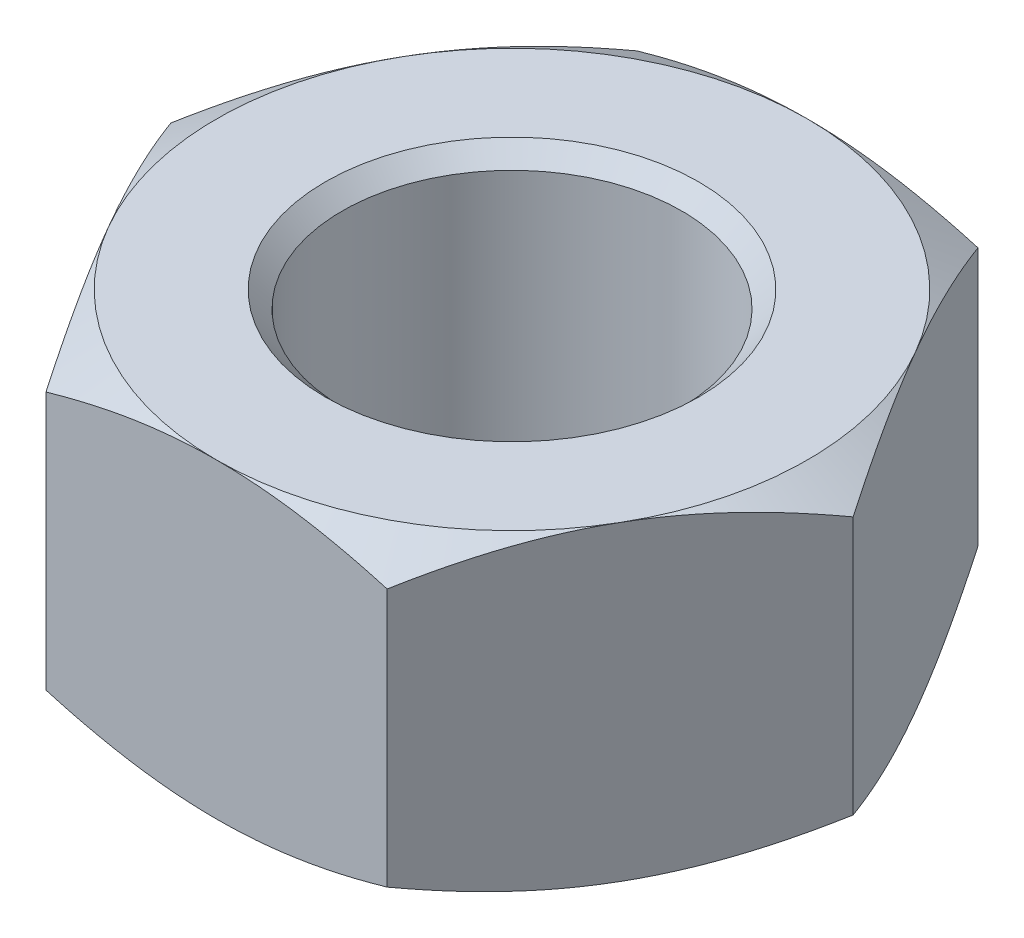
ISO-10303-21;
HEADER;
FILE_DESCRIPTION(('STEP AP214'),'2;1');
FILE_NAME('part.step','',(''),(''),'','','');
FILE_SCHEMA(('AUTOMOTIVE_DESIGN { 1 0 10303 214 1 1 1 1 }'));
ENDSEC;
DATA;
#1=APPLICATION_CONTEXT('core data for automotive mechanical design processes');
#2=APPLICATION_PROTOCOL_DEFINITION('international standard','automotive_design',2000,#1);
#3=PRODUCT_CONTEXT('',#1,'mechanical');
#4=PRODUCT('Part','Part','',(#3));
#5=PRODUCT_RELATED_PRODUCT_CATEGORY('part','',(#4));
#6=PRODUCT_DEFINITION_FORMATION('','',#4);
#7=PRODUCT_DEFINITION_CONTEXT('part definition',#1,'design');
#8=PRODUCT_DEFINITION('design','',#6,#7);
#9=PRODUCT_DEFINITION_SHAPE('','',#8);
#10=(LENGTH_UNIT() NAMED_UNIT(*) SI_UNIT(.MILLI.,.METRE.));
#11=(NAMED_UNIT(*) PLANE_ANGLE_UNIT() SI_UNIT($,.RADIAN.));
#12=(NAMED_UNIT(*) SI_UNIT($,.STERADIAN.) SOLID_ANGLE_UNIT());
#13=UNCERTAINTY_MEASURE_WITH_UNIT(LENGTH_MEASURE(1.E-05),#10,'distance_accuracy_value','');
#14=(GEOMETRIC_REPRESENTATION_CONTEXT(3) GLOBAL_UNCERTAINTY_ASSIGNED_CONTEXT((#13)) GLOBAL_UNIT_ASSIGNED_CONTEXT((#10,
#11,#12)) REPRESENTATION_CONTEXT('',''));
#15=CARTESIAN_POINT('',(0.,0.,0.));
#16=DIRECTION('',(0.,0.,1.));
#17=DIRECTION('',(1.,0.,0.));
#18=AXIS2_PLACEMENT_3D('',#15,#16,#17);
#19=CARTESIAN_POINT('',(-38.7727586640478,-69.,-4.75));
#20=DIRECTION('',(0.866025403784439,0.,-0.5));
#21=DIRECTION('',(-0.5,0.,-0.866025403784439));
#22=AXIS2_PLACEMENT_3D('',#19,#20,#21);
#23=PLANE('',#22);
#24=CARTESIAN_POINT('',(-41.5180162225476,-67.1498517286183,-9.50492557118405));
#25=CARTESIAN_POINT('',(-40.0466600833053,-68.,-6.95646198198795));
#26=CARTESIAN_POINT('',(-38.7727586640478,-68.,-4.75));
#27=CARTESIAN_POINT('',(-37.4988572447905,-68.0000000000001,-2.54353801801205));
#28=CARTESIAN_POINT('',(-36.0275011055481,-67.1498517286183,0.00492557118405202));
#29=(BOUNDED_CURVE() B_SPLINE_CURVE(2,(#24,#25,#26,#27,#28),.UNSPECIFIED.,.F.,
.F.) B_SPLINE_CURVE_WITH_KNOTS((3,2,3),(0.,5.57015057763849,11.140301155277),
.UNSPECIFIED.) CURVE() GEOMETRIC_REPRESENTATION_ITEM() RATIONAL_B_SPLINE_CURVE((1.,
1.03802697460132,1.,1.03802697460132,1.)) REPRESENTATION_ITEM(''));
#30=CARTESIAN_POINT('',(-41.5151724426986,-67.1514942239681,-9.5));
#31=VERTEX_POINT('',#30);
#32=CARTESIAN_POINT('',(-38.7727586640478,-68.,-4.75));
#33=VERTEX_POINT('',#32);
#34=EDGE_CURVE('E194',#31,#33,#29,.T.);
#35=ORIENTED_EDGE('',*,*,#34,.F.);
#36=DIRECTION('',(0.,1.,0.));
#37=VECTOR('',#36,1.);
#38=CARTESIAN_POINT('',(-41.5151724426986,-69.,-9.5));
#39=LINE('',#38,#37);
#40=CARTESIAN_POINT('',(-41.5151724426986,-58.8485057760319,-9.5));
#41=VERTEX_POINT('',#40);
#42=EDGE_CURVE('E11',#31,#41,#39,.T.);
#43=ORIENTED_EDGE('',*,*,#42,.T.);
#44=CARTESIAN_POINT('',(-36.0275011055481,-58.8501482713817,0.00492557118405869));
#45=CARTESIAN_POINT('',(-37.4988572447904,-58.,-2.54353801801204));
#46=CARTESIAN_POINT('',(-38.7727586640478,-58.,-4.75));
#47=CARTESIAN_POINT('',(-40.0466600833052,-58.,-6.95646198198795));
#48=CARTESIAN_POINT('',(-41.5180162225476,-58.8501482713817,-9.50492557118406));
#49=(BOUNDED_CURVE() B_SPLINE_CURVE(2,(#44,#45,#46,#47,#48),.UNSPECIFIED.,.F.,
.F.) B_SPLINE_CURVE_WITH_KNOTS((3,2,3),(0.,5.57015057763849,11.140301155277),
.UNSPECIFIED.) CURVE() GEOMETRIC_REPRESENTATION_ITEM() RATIONAL_B_SPLINE_CURVE((1.,
1.03802697460132,1.,1.03802697460132,1.)) REPRESENTATION_ITEM(''));
#50=CARTESIAN_POINT('',(-38.7727586640478,-58.,-4.75));
#51=VERTEX_POINT('',#50);
#52=EDGE_CURVE('E256',#51,#41,#49,.T.);
#53=ORIENTED_EDGE('',*,*,#52,.F.);
#54=CARTESIAN_POINT('',(-36.0275011055481,-58.8501482713817,0.00492557118405869));
#55=CARTESIAN_POINT('',(-37.4988572447904,-58.,-2.54353801801204));
#56=CARTESIAN_POINT('',(-38.7727586640478,-58.,-4.75));
#57=CARTESIAN_POINT('',(-40.0466600833052,-58.,-6.95646198198795));
#58=CARTESIAN_POINT('',(-41.5180162225476,-58.8501482713817,-9.50492557118406));
#59=(BOUNDED_CURVE() B_SPLINE_CURVE(2,(#54,#55,#56,#57,#58),.UNSPECIFIED.,.F.,
.F.) B_SPLINE_CURVE_WITH_KNOTS((3,2,3),(0.,5.57015057763849,11.140301155277),
.UNSPECIFIED.) CURVE() GEOMETRIC_REPRESENTATION_ITEM() RATIONAL_B_SPLINE_CURVE((1.,
1.03802697460132,1.,1.03802697460132,1.)) REPRESENTATION_ITEM(''));
#60=CARTESIAN_POINT('',(-36.0303448853971,-58.8485057760319,0.));
#61=VERTEX_POINT('',#60);
#62=EDGE_CURVE('E310',#61,#51,#59,.T.);
#63=ORIENTED_EDGE('',*,*,#62,.F.);
#64=DIRECTION('',(0.,1.,0.));
#65=VECTOR('',#64,1.);
#66=CARTESIAN_POINT('',(-36.0303448853971,-69.,0.));
#67=LINE('',#66,#65);
#68=CARTESIAN_POINT('',(-36.0303448853971,-67.1514942239681,0.));
#69=VERTEX_POINT('',#68);
#70=EDGE_CURVE('E125',#69,#61,#67,.T.);
#71=ORIENTED_EDGE('',*,*,#70,.F.);
#72=CARTESIAN_POINT('',(-41.5180162225476,-67.1498517286183,-9.50492557118405));
#73=CARTESIAN_POINT('',(-40.0466600833053,-68.,-6.95646198198795));
#74=CARTESIAN_POINT('',(-38.7727586640478,-68.,-4.75));
#75=CARTESIAN_POINT('',(-37.4988572447905,-68.0000000000001,-2.54353801801205));
#76=CARTESIAN_POINT('',(-36.0275011055481,-67.1498517286183,0.00492557118405202));
#77=(BOUNDED_CURVE() B_SPLINE_CURVE(2,(#72,#73,#74,#75,#76),.UNSPECIFIED.,.F.,
.F.) B_SPLINE_CURVE_WITH_KNOTS((3,2,3),(0.,5.57015057763849,11.140301155277),
.UNSPECIFIED.) CURVE() GEOMETRIC_REPRESENTATION_ITEM() RATIONAL_B_SPLINE_CURVE((1.,
1.03802697460132,1.,1.03802697460132,1.)) REPRESENTATION_ITEM(''));
#78=EDGE_CURVE('E265',#33,#69,#77,.T.);
#79=ORIENTED_EDGE('',*,*,#78,.F.);
#80=EDGE_LOOP('',(#35,#43,#53,#63,#71,#79));
#81=FACE_BOUND('',#80,.T.);
#82=ADVANCED_FACE('F16',(#81),#23,.T.);
#83=CARTESIAN_POINT('',(-47.,-69.,-9.5));
#84=DIRECTION('',(0.,0.,-1.));
#85=DIRECTION('',(-1.,0.,0.));
#86=AXIS2_PLACEMENT_3D('',#83,#84,#85);
#87=PLANE('',#86);
#88=CARTESIAN_POINT('',(-52.4905151169995,-67.1498517286183,-9.5));
#89=CARTESIAN_POINT('',(-49.5478028385149,-68.0000000000001,-9.50000000000001));
#90=CARTESIAN_POINT('',(-47.,-68.,-9.5));
#91=CARTESIAN_POINT('',(-44.4521971614852,-68.0000000000001,-9.50000000000001));
#92=CARTESIAN_POINT('',(-41.5094848830005,-67.1498517286183,-9.5));
#93=(BOUNDED_CURVE() B_SPLINE_CURVE(2,(#88,#89,#90,#91,#92),.UNSPECIFIED.,.F.,
.F.) B_SPLINE_CURVE_WITH_KNOTS((3,2,3),(0.,5.57015057763849,11.140301155277),
.UNSPECIFIED.) CURVE() GEOMETRIC_REPRESENTATION_ITEM() RATIONAL_B_SPLINE_CURVE((1.,
1.03802697460134,1.,1.03802697460134,1.)) REPRESENTATION_ITEM(''));
#94=CARTESIAN_POINT('',(-52.4848275573015,-67.1514942239681,-9.5));
#95=VERTEX_POINT('',#94);
#96=CARTESIAN_POINT('',(-47.,-68.,-9.5));
#97=VERTEX_POINT('',#96);
#98=EDGE_CURVE('E137',#95,#97,#93,.T.);
#99=ORIENTED_EDGE('',*,*,#98,.F.);
#100=DIRECTION('',(0.,1.,0.));
#101=VECTOR('',#100,1.);
#102=CARTESIAN_POINT('',(-52.4848275573015,-69.,-9.5));
#103=LINE('',#102,#101);
#104=CARTESIAN_POINT('',(-52.4848275573015,-58.8485057760319,-9.5));
#105=VERTEX_POINT('',#104);
#106=EDGE_CURVE('E28',#95,#105,#103,.T.);
#107=ORIENTED_EDGE('',*,*,#106,.T.);
#108=CARTESIAN_POINT('',(-41.5094848830005,-58.8501482713817,-9.5));
#109=CARTESIAN_POINT('',(-44.4521971614851,-58.,-9.50000000000001));
#110=CARTESIAN_POINT('',(-47.,-58.,-9.5));
#111=CARTESIAN_POINT('',(-49.5478028385149,-58.,-9.50000000000001));
#112=CARTESIAN_POINT('',(-52.4905151169995,-58.8501482713817,-9.5));
#113=(BOUNDED_CURVE() B_SPLINE_CURVE(2,(#108,#109,#110,#111,#112),.UNSPECIFIED.,.F.,
.F.) B_SPLINE_CURVE_WITH_KNOTS((3,2,3),(0.,5.5701505776385,11.140301155277),
.UNSPECIFIED.) CURVE() GEOMETRIC_REPRESENTATION_ITEM() RATIONAL_B_SPLINE_CURVE((1.,
1.03802697460132,1.,1.03802697460132,1.)) REPRESENTATION_ITEM(''));
#114=CARTESIAN_POINT('',(-47.,-58.,-9.5));
#115=VERTEX_POINT('',#114);
#116=EDGE_CURVE('E20',#115,#105,#113,.T.);
#117=ORIENTED_EDGE('',*,*,#116,.F.);
#118=CARTESIAN_POINT('',(-41.5094848830005,-58.8501482713817,-9.5));
#119=CARTESIAN_POINT('',(-44.4521971614851,-58.,-9.50000000000001));
#120=CARTESIAN_POINT('',(-47.,-58.,-9.5));
#121=CARTESIAN_POINT('',(-49.5478028385149,-58.,-9.50000000000001));
#122=CARTESIAN_POINT('',(-52.4905151169995,-58.8501482713817,-9.5));
#123=(BOUNDED_CURVE() B_SPLINE_CURVE(2,(#118,#119,#120,#121,#122),.UNSPECIFIED.,.F.,
.F.) B_SPLINE_CURVE_WITH_KNOTS((3,2,3),(0.,5.5701505776385,11.140301155277),
.UNSPECIFIED.) CURVE() GEOMETRIC_REPRESENTATION_ITEM() RATIONAL_B_SPLINE_CURVE((1.,
1.03802697460132,1.,1.03802697460132,1.)) REPRESENTATION_ITEM(''));
#124=EDGE_CURVE('E247',#41,#115,#123,.T.);
#125=ORIENTED_EDGE('',*,*,#124,.F.);
#126=ORIENTED_EDGE('',*,*,#42,.F.);
#127=CARTESIAN_POINT('',(-52.4905151169995,-67.1498517286183,-9.5));
#128=CARTESIAN_POINT('',(-49.5478028385149,-68.0000000000001,-9.50000000000001));
#129=CARTESIAN_POINT('',(-47.,-68.,-9.5));
#130=CARTESIAN_POINT('',(-44.4521971614852,-68.0000000000001,-9.50000000000001));
#131=CARTESIAN_POINT('',(-41.5094848830005,-67.1498517286183,-9.5));
#132=(BOUNDED_CURVE() B_SPLINE_CURVE(2,(#127,#128,#129,#130,#131),.UNSPECIFIED.,.F.,
.F.) B_SPLINE_CURVE_WITH_KNOTS((3,2,3),(0.,5.57015057763849,11.140301155277),
.UNSPECIFIED.) CURVE() GEOMETRIC_REPRESENTATION_ITEM() RATIONAL_B_SPLINE_CURVE((1.,
1.03802697460134,1.,1.03802697460134,1.)) REPRESENTATION_ITEM(''));
#133=EDGE_CURVE('E186',#97,#31,#132,.T.);
#134=ORIENTED_EDGE('',*,*,#133,.F.);
#135=EDGE_LOOP('',(#99,#107,#117,#125,#126,#134));
#136=FACE_BOUND('',#135,.T.);
#137=ADVANCED_FACE('F132',(#136),#87,.T.);
#138=CARTESIAN_POINT('',(-55.2272413359522,-69.,-4.75));
#139=DIRECTION('',(-0.866025403784439,0.,-0.5));
#140=DIRECTION('',(-0.5,0.,0.866025403784439));
#141=AXIS2_PLACEMENT_3D('',#138,#139,#140);
#142=PLANE('',#141);
#143=CARTESIAN_POINT('',(-57.9724988944519,-67.1498517286183,0.00492557118405107));
#144=CARTESIAN_POINT('',(-56.5011427552097,-68.0000000000001,-2.54353801801205));
#145=CARTESIAN_POINT('',(-55.2272413359522,-68.,-4.75));
#146=CARTESIAN_POINT('',(-53.9533399166947,-68.,-6.95646198198796));
#147=CARTESIAN_POINT('',(-52.4819837774524,-67.1498517286183,-9.50492557118406));
#148=(BOUNDED_CURVE() B_SPLINE_CURVE(2,(#143,#144,#145,#146,#147),.UNSPECIFIED.,.F.,
.F.) B_SPLINE_CURVE_WITH_KNOTS((3,2,3),(0.,5.57015057763849,11.140301155277),
.UNSPECIFIED.) CURVE() GEOMETRIC_REPRESENTATION_ITEM() RATIONAL_B_SPLINE_CURVE((1.,
1.03802697460134,1.,1.03802697460135,1.)) REPRESENTATION_ITEM(''));
#149=CARTESIAN_POINT('',(-57.9696551146029,-67.1514942239681,0.));
#150=VERTEX_POINT('',#149);
#151=CARTESIAN_POINT('',(-55.2272413359522,-68.,-4.75));
#152=VERTEX_POINT('',#151);
#153=EDGE_CURVE('E171',#150,#152,#148,.T.);
#154=ORIENTED_EDGE('',*,*,#153,.F.);
#155=DIRECTION('',(0.,1.,0.));
#156=VECTOR('',#155,1.);
#157=CARTESIAN_POINT('',(-57.9696551146029,-69.,0.));
#158=LINE('',#157,#156);
#159=CARTESIAN_POINT('',(-57.9696551146029,-58.8485057760319,0.));
#160=VERTEX_POINT('',#159);
#161=EDGE_CURVE('E92',#150,#160,#158,.T.);
#162=ORIENTED_EDGE('',*,*,#161,.T.);
#163=CARTESIAN_POINT('',(-52.4819837774524,-58.8501482713817,-9.50492557118407));
#164=CARTESIAN_POINT('',(-53.9533399166948,-58.,-6.95646198198798));
#165=CARTESIAN_POINT('',(-55.2272413359522,-58.,-4.75));
#166=CARTESIAN_POINT('',(-56.5011427552097,-58.,-2.54353801801203));
#167=CARTESIAN_POINT('',(-57.9724988944519,-58.8501482713817,0.00492557118405964));
#168=(BOUNDED_CURVE() B_SPLINE_CURVE(2,(#163,#164,#165,#166,#167),.UNSPECIFIED.,.F.,
.F.) B_SPLINE_CURVE_WITH_KNOTS((3,2,3),(0.,5.5701505776385,11.140301155277),
.UNSPECIFIED.) CURVE() GEOMETRIC_REPRESENTATION_ITEM() RATIONAL_B_SPLINE_CURVE((1.,
1.03802697460132,1.,1.03802697460132,1.)) REPRESENTATION_ITEM(''));
#169=CARTESIAN_POINT('',(-55.2272413359522,-58.,-4.75));
#170=VERTEX_POINT('',#169);
#171=EDGE_CURVE('E150',#170,#160,#168,.T.);
#172=ORIENTED_EDGE('',*,*,#171,.F.);
#173=CARTESIAN_POINT('',(-52.4819837774524,-58.8501482713817,-9.50492557118407));
#174=CARTESIAN_POINT('',(-53.9533399166948,-58.,-6.95646198198798));
#175=CARTESIAN_POINT('',(-55.2272413359522,-58.,-4.75));
#176=CARTESIAN_POINT('',(-56.5011427552097,-58.,-2.54353801801203));
#177=CARTESIAN_POINT('',(-57.9724988944519,-58.8501482713817,0.00492557118405964));
#178=(BOUNDED_CURVE() B_SPLINE_CURVE(2,(#173,#174,#175,#176,#177),.UNSPECIFIED.,.F.,
.F.) B_SPLINE_CURVE_WITH_KNOTS((3,2,3),(0.,5.5701505776385,11.140301155277),
.UNSPECIFIED.) CURVE() GEOMETRIC_REPRESENTATION_ITEM() RATIONAL_B_SPLINE_CURVE((1.,
1.03802697460132,1.,1.03802697460132,1.)) REPRESENTATION_ITEM(''));
#179=EDGE_CURVE('E145',#105,#170,#178,.T.);
#180=ORIENTED_EDGE('',*,*,#179,.F.);
#181=ORIENTED_EDGE('',*,*,#106,.F.);
#182=CARTESIAN_POINT('',(-57.9724988944519,-67.1498517286183,0.00492557118405107));
#183=CARTESIAN_POINT('',(-56.5011427552097,-68.0000000000001,-2.54353801801205));
#184=CARTESIAN_POINT('',(-55.2272413359522,-68.,-4.75));
#185=CARTESIAN_POINT('',(-53.9533399166947,-68.,-6.95646198198796));
#186=CARTESIAN_POINT('',(-52.4819837774524,-67.1498517286183,-9.50492557118406));
#187=(BOUNDED_CURVE() B_SPLINE_CURVE(2,(#182,#183,#184,#185,#186),.UNSPECIFIED.,.F.,
.F.) B_SPLINE_CURVE_WITH_KNOTS((3,2,3),(0.,5.57015057763849,11.140301155277),
.UNSPECIFIED.) CURVE() GEOMETRIC_REPRESENTATION_ITEM() RATIONAL_B_SPLINE_CURVE((1.,
1.03802697460134,1.,1.03802697460135,1.)) REPRESENTATION_ITEM(''));
#188=EDGE_CURVE('E343',#152,#95,#187,.T.);
#189=ORIENTED_EDGE('',*,*,#188,.F.);
#190=EDGE_LOOP('',(#154,#162,#172,#180,#181,#189));
#191=FACE_BOUND('',#190,.T.);
#192=ADVANCED_FACE('F149',(#191),#142,.T.);
#193=CARTESIAN_POINT('',(-38.7727586640478,-69.,4.75));
#194=DIRECTION('',(0.866025403784439,0.,0.5));
#195=DIRECTION('',(0.5,0.,-0.866025403784439));
#196=AXIS2_PLACEMENT_3D('',#193,#194,#195);
#197=PLANE('',#196);
#198=CARTESIAN_POINT('',(-36.0275011055481,-67.1498517286183,-0.00492557118405583));
#199=CARTESIAN_POINT('',(-37.4988572447904,-68.,2.54353801801203));
#200=CARTESIAN_POINT('',(-38.7727586640478,-68.,4.75));
#201=CARTESIAN_POINT('',(-40.0466600833052,-67.9999999999999,6.95646198198796));
#202=CARTESIAN_POINT('',(-41.5180162225476,-67.1498517286183,9.50492557118405));
#203=(BOUNDED_CURVE() B_SPLINE_CURVE(2,(#198,#199,#200,#201,#202),.UNSPECIFIED.,.F.,
.F.) B_SPLINE_CURVE_WITH_KNOTS((3,2,3),(0.,5.57015057763849,11.140301155277),
.UNSPECIFIED.) CURVE() GEOMETRIC_REPRESENTATION_ITEM() RATIONAL_B_SPLINE_CURVE((1.,
1.03802697460133,1.,1.03802697460135,1.)) REPRESENTATION_ITEM(''));
#204=CARTESIAN_POINT('',(-38.7727586640478,-68.,4.75));
#205=VERTEX_POINT('',#204);
#206=CARTESIAN_POINT('',(-41.5151724426986,-67.1514942239681,9.5));
#207=VERTEX_POINT('',#206);
#208=EDGE_CURVE('E196',#205,#207,#203,.T.);
#209=ORIENTED_EDGE('',*,*,#208,.F.);
#210=CARTESIAN_POINT('',(-36.0275011055481,-67.1498517286183,-0.00492557118405583));
#211=CARTESIAN_POINT('',(-37.4988572447904,-68.,2.54353801801203));
#212=CARTESIAN_POINT('',(-38.7727586640478,-68.,4.75));
#213=CARTESIAN_POINT('',(-40.0466600833052,-67.9999999999999,6.95646198198796));
#214=CARTESIAN_POINT('',(-41.5180162225476,-67.1498517286183,9.50492557118405));
#215=(BOUNDED_CURVE() B_SPLINE_CURVE(2,(#210,#211,#212,#213,#214),.UNSPECIFIED.,.F.,
.F.) B_SPLINE_CURVE_WITH_KNOTS((3,2,3),(0.,5.57015057763849,11.140301155277),
.UNSPECIFIED.) CURVE() GEOMETRIC_REPRESENTATION_ITEM() RATIONAL_B_SPLINE_CURVE((1.,
1.03802697460133,1.,1.03802697460135,1.)) REPRESENTATION_ITEM(''));
#216=EDGE_CURVE('E155',#69,#205,#215,.T.);
#217=ORIENTED_EDGE('',*,*,#216,.F.);
#218=ORIENTED_EDGE('',*,*,#70,.T.);
#219=CARTESIAN_POINT('',(-41.5180162225476,-58.8501482713817,9.50492557118406));
#220=CARTESIAN_POINT('',(-40.0466600833053,-58.,6.95646198198797));
#221=CARTESIAN_POINT('',(-38.7727586640478,-58.,4.75));
#222=CARTESIAN_POINT('',(-37.4988572447904,-58.,2.54353801801203));
#223=CARTESIAN_POINT('',(-36.0275011055481,-58.8501482713817,-0.00492557118406345));
#224=(BOUNDED_CURVE() B_SPLINE_CURVE(2,(#219,#220,#221,#222,#223),.UNSPECIFIED.,.F.,
.F.) B_SPLINE_CURVE_WITH_KNOTS((3,2,3),(0.,5.5701505776385,11.140301155277),
.UNSPECIFIED.) CURVE() GEOMETRIC_REPRESENTATION_ITEM() RATIONAL_B_SPLINE_CURVE((1.,
1.03802697460133,1.,1.03802697460134,1.)) REPRESENTATION_ITEM(''));
#225=CARTESIAN_POINT('',(-38.7727586640478,-58.,4.75));
#226=VERTEX_POINT('',#225);
#227=EDGE_CURVE('E214',#226,#61,#224,.T.);
#228=ORIENTED_EDGE('',*,*,#227,.F.);
#229=CARTESIAN_POINT('',(-41.5180162225476,-58.8501482713817,9.50492557118406));
#230=CARTESIAN_POINT('',(-40.0466600833053,-58.,6.95646198198797));
#231=CARTESIAN_POINT('',(-38.7727586640478,-58.,4.75));
#232=CARTESIAN_POINT('',(-37.4988572447904,-58.,2.54353801801203));
#233=CARTESIAN_POINT('',(-36.0275011055481,-58.8501482713817,-0.00492557118406345));
#234=(BOUNDED_CURVE() B_SPLINE_CURVE(2,(#229,#230,#231,#232,#233),.UNSPECIFIED.,.F.,
.F.) B_SPLINE_CURVE_WITH_KNOTS((3,2,3),(0.,5.5701505776385,11.140301155277),
.UNSPECIFIED.) CURVE() GEOMETRIC_REPRESENTATION_ITEM() RATIONAL_B_SPLINE_CURVE((1.,
1.03802697460133,1.,1.03802697460134,1.)) REPRESENTATION_ITEM(''));
#235=CARTESIAN_POINT('',(-41.5151724426986,-58.8485057760319,9.5));
#236=VERTEX_POINT('',#235);
#237=EDGE_CURVE('E215',#236,#226,#234,.T.);
#238=ORIENTED_EDGE('',*,*,#237,.F.);
#239=DIRECTION('',(0.,1.,0.));
#240=VECTOR('',#239,1.);
#241=CARTESIAN_POINT('',(-41.5151724426986,-69.,9.5));
#242=LINE('',#241,#240);
#243=EDGE_CURVE('E291',#207,#236,#242,.T.);
#244=ORIENTED_EDGE('',*,*,#243,.F.);
#245=EDGE_LOOP('',(#209,#217,#218,#228,#238,#244));
#246=FACE_BOUND('',#245,.T.);
#247=ADVANCED_FACE('F380',(#246),#197,.T.);
#248=CARTESIAN_POINT('',(-47.,-69.,9.5));
#249=DIRECTION('',(0.,0.,1.));
#250=DIRECTION('',(1.,0.,0.));
#251=AXIS2_PLACEMENT_3D('',#248,#249,#250);
#252=PLANE('',#251);
#253=CARTESIAN_POINT('',(-41.5094848830005,-67.1498517286183,9.5));
#254=CARTESIAN_POINT('',(-44.4521971614851,-68.0000000000001,9.5));
#255=CARTESIAN_POINT('',(-47.,-68.,9.5));
#256=CARTESIAN_POINT('',(-49.5478028385148,-68.,9.49999999999999));
#257=CARTESIAN_POINT('',(-52.4905151169995,-67.1498517286183,9.5));
#258=(BOUNDED_CURVE() B_SPLINE_CURVE(2,(#253,#254,#255,#256,#257),.UNSPECIFIED.,.F.,
.F.) B_SPLINE_CURVE_WITH_KNOTS((3,2,3),(0.,5.5701505776385,11.140301155277),
.UNSPECIFIED.) CURVE() GEOMETRIC_REPRESENTATION_ITEM() RATIONAL_B_SPLINE_CURVE((1.,
1.03802697460134,1.,1.03802697460134,1.)) REPRESENTATION_ITEM(''));
#259=CARTESIAN_POINT('',(-47.,-68.,9.5));
#260=VERTEX_POINT('',#259);
#261=CARTESIAN_POINT('',(-52.4848275573015,-67.1514942239681,9.5));
#262=VERTEX_POINT('',#261);
#263=EDGE_CURVE('E163',#260,#262,#258,.T.);
#264=ORIENTED_EDGE('',*,*,#263,.F.);
#265=CARTESIAN_POINT('',(-41.5094848830005,-67.1498517286183,9.5));
#266=CARTESIAN_POINT('',(-44.4521971614851,-68.0000000000001,9.5));
#267=CARTESIAN_POINT('',(-47.,-68.,9.5));
#268=CARTESIAN_POINT('',(-49.5478028385148,-68.,9.49999999999999));
#269=CARTESIAN_POINT('',(-52.4905151169995,-67.1498517286183,9.5));
#270=(BOUNDED_CURVE() B_SPLINE_CURVE(2,(#265,#266,#267,#268,#269),.UNSPECIFIED.,.F.,
.F.) B_SPLINE_CURVE_WITH_KNOTS((3,2,3),(0.,5.5701505776385,11.140301155277),
.UNSPECIFIED.) CURVE() GEOMETRIC_REPRESENTATION_ITEM() RATIONAL_B_SPLINE_CURVE((1.,
1.03802697460134,1.,1.03802697460134,1.)) REPRESENTATION_ITEM(''));
#271=EDGE_CURVE('E210',#207,#260,#270,.T.);
#272=ORIENTED_EDGE('',*,*,#271,.F.);
#273=ORIENTED_EDGE('',*,*,#243,.T.);
#274=CARTESIAN_POINT('',(-52.4905151169995,-58.8501482713817,9.5));
#275=CARTESIAN_POINT('',(-49.5478028385149,-58.,9.5));
#276=CARTESIAN_POINT('',(-47.,-58.,9.5));
#277=CARTESIAN_POINT('',(-44.4521971614851,-57.9999999999999,9.5));
#278=CARTESIAN_POINT('',(-41.5094848830005,-58.8501482713817,9.5));
#279=(BOUNDED_CURVE() B_SPLINE_CURVE(2,(#274,#275,#276,#277,#278),.UNSPECIFIED.,.F.,
.F.) B_SPLINE_CURVE_WITH_KNOTS((3,2,3),(0.,5.5701505776385,11.140301155277),
.UNSPECIFIED.) CURVE() GEOMETRIC_REPRESENTATION_ITEM() RATIONAL_B_SPLINE_CURVE((1.,
1.03802697460136,1.,1.03802697460136,1.)) REPRESENTATION_ITEM(''));
#280=CARTESIAN_POINT('',(-47.,-58.,9.5));
#281=VERTEX_POINT('',#280);
#282=EDGE_CURVE('E216',#281,#236,#279,.T.);
#283=ORIENTED_EDGE('',*,*,#282,.F.);
#284=CARTESIAN_POINT('',(-52.4905151169995,-58.8501482713817,9.5));
#285=CARTESIAN_POINT('',(-49.5478028385149,-58.,9.5));
#286=CARTESIAN_POINT('',(-47.,-58.,9.5));
#287=CARTESIAN_POINT('',(-44.4521971614851,-57.9999999999999,9.5));
#288=CARTESIAN_POINT('',(-41.5094848830005,-58.8501482713817,9.5));
#289=(BOUNDED_CURVE() B_SPLINE_CURVE(2,(#284,#285,#286,#287,#288),.UNSPECIFIED.,.F.,
.F.) B_SPLINE_CURVE_WITH_KNOTS((3,2,3),(0.,5.5701505776385,11.140301155277),
.UNSPECIFIED.) CURVE() GEOMETRIC_REPRESENTATION_ITEM() RATIONAL_B_SPLINE_CURVE((1.,
1.03802697460136,1.,1.03802697460136,1.)) REPRESENTATION_ITEM(''));
#290=CARTESIAN_POINT('',(-52.4848275573015,-58.8485057760319,9.5));
#291=VERTEX_POINT('',#290);
#292=EDGE_CURVE('E246',#291,#281,#289,.T.);
#293=ORIENTED_EDGE('',*,*,#292,.F.);
#294=DIRECTION('',(0.,1.,0.));
#295=VECTOR('',#294,1.);
#296=CARTESIAN_POINT('',(-52.4848275573015,-69.,9.5));
#297=LINE('',#296,#295);
#298=EDGE_CURVE('E161',#262,#291,#297,.T.);
#299=ORIENTED_EDGE('',*,*,#298,.F.);
#300=EDGE_LOOP('',(#264,#272,#273,#283,#293,#299));
#301=FACE_BOUND('',#300,.T.);
#302=ADVANCED_FACE('F371',(#301),#252,.T.);
#303=CARTESIAN_POINT('',(-55.2272413359522,-69.,4.75));
#304=DIRECTION('',(-0.866025403784439,0.,0.5));
#305=DIRECTION('',(0.5,0.,0.866025403784439));
#306=AXIS2_PLACEMENT_3D('',#303,#304,#305);
#307=PLANE('',#306);
#308=CARTESIAN_POINT('',(-52.4819837774524,-67.1498517286183,9.50492557118405));
#309=CARTESIAN_POINT('',(-53.9533399166948,-68.,6.95646198198795));
#310=CARTESIAN_POINT('',(-55.2272413359522,-68.,4.75));
#311=CARTESIAN_POINT('',(-56.5011427552096,-68.,2.54353801801204));
#312=CARTESIAN_POINT('',(-57.9724988944519,-67.1498517286183,-0.00492557118405964));
#313=(BOUNDED_CURVE() B_SPLINE_CURVE(2,(#308,#309,#310,#311,#312),.UNSPECIFIED.,.F.,
.F.) B_SPLINE_CURVE_WITH_KNOTS((3,2,3),(0.,5.57015057763849,11.140301155277),
.UNSPECIFIED.) CURVE() GEOMETRIC_REPRESENTATION_ITEM() RATIONAL_B_SPLINE_CURVE((1.,
1.03802697460133,1.,1.03802697460134,1.)) REPRESENTATION_ITEM(''));
#314=CARTESIAN_POINT('',(-55.2272413359522,-68.,4.75));
#315=VERTEX_POINT('',#314);
#316=EDGE_CURVE('E99',#315,#150,#313,.T.);
#317=ORIENTED_EDGE('',*,*,#316,.F.);
#318=CARTESIAN_POINT('',(-52.4819837774524,-67.1498517286183,9.50492557118405));
#319=CARTESIAN_POINT('',(-53.9533399166948,-68.,6.95646198198795));
#320=CARTESIAN_POINT('',(-55.2272413359522,-68.,4.75));
#321=CARTESIAN_POINT('',(-56.5011427552096,-68.,2.54353801801204));
#322=CARTESIAN_POINT('',(-57.9724988944519,-67.1498517286183,-0.00492557118405964));
#323=(BOUNDED_CURVE() B_SPLINE_CURVE(2,(#318,#319,#320,#321,#322),.UNSPECIFIED.,.F.,
.F.) B_SPLINE_CURVE_WITH_KNOTS((3,2,3),(0.,5.57015057763849,11.140301155277),
.UNSPECIFIED.) CURVE() GEOMETRIC_REPRESENTATION_ITEM() RATIONAL_B_SPLINE_CURVE((1.,
1.03802697460133,1.,1.03802697460134,1.)) REPRESENTATION_ITEM(''));
#324=EDGE_CURVE('E178',#262,#315,#323,.T.);
#325=ORIENTED_EDGE('',*,*,#324,.F.);
#326=ORIENTED_EDGE('',*,*,#298,.T.);
#327=CARTESIAN_POINT('',(-57.9724988944519,-58.8501482713817,-0.00492557118406345));
#328=CARTESIAN_POINT('',(-56.5011427552095,-58.,2.54353801801203));
#329=CARTESIAN_POINT('',(-55.2272413359522,-58.,4.75));
#330=CARTESIAN_POINT('',(-53.9533399166947,-58.,6.95646198198796));
#331=CARTESIAN_POINT('',(-52.4819837774524,-58.8501482713817,9.50492557118406));
#332=(BOUNDED_CURVE() B_SPLINE_CURVE(2,(#327,#328,#329,#330,#331),.UNSPECIFIED.,.F.,
.F.) B_SPLINE_CURVE_WITH_KNOTS((3,2,3),(0.,5.57015057763849,11.140301155277),
.UNSPECIFIED.) CURVE() GEOMETRIC_REPRESENTATION_ITEM() RATIONAL_B_SPLINE_CURVE((1.,
1.03802697460132,1.,1.03802697460134,1.)) REPRESENTATION_ITEM(''));
#333=CARTESIAN_POINT('',(-55.2272413359522,-58.,4.75));
#334=VERTEX_POINT('',#333);
#335=EDGE_CURVE('E115',#334,#291,#332,.T.);
#336=ORIENTED_EDGE('',*,*,#335,.F.);
#337=CARTESIAN_POINT('',(-57.9724988944519,-58.8501482713817,-0.00492557118406345));
#338=CARTESIAN_POINT('',(-56.5011427552095,-58.,2.54353801801203));
#339=CARTESIAN_POINT('',(-55.2272413359522,-58.,4.75));
#340=CARTESIAN_POINT('',(-53.9533399166947,-58.,6.95646198198796));
#341=CARTESIAN_POINT('',(-52.4819837774524,-58.8501482713817,9.50492557118406));
#342=(BOUNDED_CURVE() B_SPLINE_CURVE(2,(#337,#338,#339,#340,#341),.UNSPECIFIED.,.F.,
.F.) B_SPLINE_CURVE_WITH_KNOTS((3,2,3),(0.,5.57015057763849,11.140301155277),
.UNSPECIFIED.) CURVE() GEOMETRIC_REPRESENTATION_ITEM() RATIONAL_B_SPLINE_CURVE((1.,
1.03802697460132,1.,1.03802697460134,1.)) REPRESENTATION_ITEM(''));
#343=EDGE_CURVE('E148',#160,#334,#342,.T.);
#344=ORIENTED_EDGE('',*,*,#343,.F.);
#345=ORIENTED_EDGE('',*,*,#161,.F.);
#346=EDGE_LOOP('',(#317,#325,#326,#336,#344,#345));
#347=FACE_BOUND('',#346,.T.);
#348=ADVANCED_FACE('F367',(#347),#307,.T.);
#349=CARTESIAN_POINT('',(-39.25,-68.,0.));
#350=DIRECTION('',(0.,-1.,0.));
#351=DIRECTION('',(-1.,0.,0.));
#352=AXIS2_PLACEMENT_3D('',#349,#350,#351);
#353=PLANE('',#352);
#354=CARTESIAN_POINT('',(-47.,-68.,0.));
#355=DIRECTION('',(0.,1.,0.));
#356=DIRECTION('',(1.,0.,0.));
#357=AXIS2_PLACEMENT_3D('',#354,#355,#356);
#358=CIRCLE('',#357,6.);
#359=CARTESIAN_POINT('',(-41.,-68.,0.));
#360=VERTEX_POINT('',#359);
#361=EDGE_CURVE('E35',#360,#360,#358,.T.);
#362=ORIENTED_EDGE('',*,*,#361,.T.);
#363=EDGE_LOOP('',(#362));
#364=FACE_BOUND('',#363,.T.);
#365=CARTESIAN_POINT('',(-47.,-68.,0.));
#366=DIRECTION('',(0.,1.,0.));
#367=DIRECTION('',(1.,0.,0.));
#368=AXIS2_PLACEMENT_3D('',#365,#366,#367);
#369=CIRCLE('',#368,9.5);
#370=EDGE_CURVE('E152',#205,#33,#369,.T.);
#371=ORIENTED_EDGE('',*,*,#370,.F.);
#372=CARTESIAN_POINT('',(-47.,-68.,0.));
#373=DIRECTION('',(0.,1.,0.));
#374=DIRECTION('',(1.,0.,0.));
#375=AXIS2_PLACEMENT_3D('',#372,#373,#374);
#376=CIRCLE('',#375,9.5);
#377=EDGE_CURVE('E204',#260,#205,#376,.T.);
#378=ORIENTED_EDGE('',*,*,#377,.F.);
#379=CARTESIAN_POINT('',(-47.,-68.,0.));
#380=DIRECTION('',(0.,1.,0.));
#381=DIRECTION('',(1.,0.,0.));
#382=AXIS2_PLACEMENT_3D('',#379,#380,#381);
#383=CIRCLE('',#382,9.5);
#384=EDGE_CURVE('E172',#315,#260,#383,.T.);
#385=ORIENTED_EDGE('',*,*,#384,.F.);
#386=CARTESIAN_POINT('',(-47.,-68.,0.));
#387=DIRECTION('',(0.,1.,0.));
#388=DIRECTION('',(1.,0.,0.));
#389=AXIS2_PLACEMENT_3D('',#386,#387,#388);
#390=CIRCLE('',#389,9.5);
#391=EDGE_CURVE('E179',#152,#315,#390,.T.);
#392=ORIENTED_EDGE('',*,*,#391,.F.);
#393=CARTESIAN_POINT('',(-47.,-68.,0.));
#394=DIRECTION('',(0.,1.,0.));
#395=DIRECTION('',(1.,0.,0.));
#396=AXIS2_PLACEMENT_3D('',#393,#394,#395);
#397=CIRCLE('',#396,9.5);
#398=EDGE_CURVE('E195',#97,#152,#397,.T.);
#399=ORIENTED_EDGE('',*,*,#398,.F.);
#400=CARTESIAN_POINT('',(-47.,-68.,0.));
#401=DIRECTION('',(0.,1.,0.));
#402=DIRECTION('',(1.,0.,0.));
#403=AXIS2_PLACEMENT_3D('',#400,#401,#402);
#404=CIRCLE('',#403,9.5);
#405=EDGE_CURVE('E262',#33,#97,#404,.T.);
#406=ORIENTED_EDGE('',*,*,#405,.F.);
#407=EDGE_LOOP('',(#371,#378,#385,#392,#399,#406));
#408=FACE_BOUND('',#407,.T.);
#409=ADVANCED_FACE('F390',(#364,#408),#353,.T.);
#410=CARTESIAN_POINT('',(-47.,-67.729375,0.));
#411=DIRECTION('',(0.,-1.,0.));
#412=DIRECTION('',(1.,0.,0.));
#413=AXIS2_PLACEMENT_3D('',#410,#411,#412);
#414=CONICAL_SURFACE('',#413,5.729375,0.785398163397448);
#415=CARTESIAN_POINT('',(-47.,-67.45875,0.));
#416=DIRECTION('',(0.,1.,0.));
#417=DIRECTION('',(1.,0.,0.));
#418=AXIS2_PLACEMENT_3D('',#415,#416,#417);
#419=CIRCLE('',#418,5.45875);
#420=CARTESIAN_POINT('',(-41.54125,-67.45875,0.));
#421=VERTEX_POINT('',#420);
#422=EDGE_CURVE('E227',#421,#421,#419,.T.);
#423=ORIENTED_EDGE('',*,*,#422,.T.);
#424=EDGE_LOOP('',(#423));
#425=FACE_BOUND('',#424,.T.);
#426=ORIENTED_EDGE('',*,*,#361,.F.);
#427=EDGE_LOOP('',(#426));
#428=FACE_BOUND('',#427,.T.);
#429=ADVANCED_FACE('F438',(#425,#428),#414,.F.);
#430=CARTESIAN_POINT('',(-47.,-63.,0.));
#431=DIRECTION('',(0.,-1.,0.));
#432=DIRECTION('',(1.,0.,0.));
#433=AXIS2_PLACEMENT_3D('',#430,#431,#432);
#434=CYLINDRICAL_SURFACE('',#433,5.45875);
#435=CARTESIAN_POINT('',(-47.,-58.54125,0.));
#436=DIRECTION('',(0.,1.,0.));
#437=DIRECTION('',(1.,0.,0.));
#438=AXIS2_PLACEMENT_3D('',#435,#436,#437);
#439=CIRCLE('',#438,5.45875);
#440=CARTESIAN_POINT('',(-41.54125,-58.54125,0.));
#441=VERTEX_POINT('',#440);
#442=EDGE_CURVE('E221',#441,#441,#439,.T.);
#443=ORIENTED_EDGE('',*,*,#442,.T.);
#444=EDGE_LOOP('',(#443));
#445=FACE_BOUND('',#444,.T.);
#446=ORIENTED_EDGE('',*,*,#422,.F.);
#447=EDGE_LOOP('',(#446));
#448=FACE_BOUND('',#447,.T.);
#449=ADVANCED_FACE('F445',(#445,#448),#434,.F.);
#450=CARTESIAN_POINT('',(-47.,-58.270625,0.));
#451=DIRECTION('',(0.,1.,0.));
#452=DIRECTION('',(1.,0.,0.));
#453=AXIS2_PLACEMENT_3D('',#450,#451,#452);
#454=CONICAL_SURFACE('',#453,5.729375,0.785398163397448);
#455=CARTESIAN_POINT('',(-47.,-58.,0.));
#456=DIRECTION('',(0.,1.,0.));
#457=DIRECTION('',(1.,0.,0.));
#458=AXIS2_PLACEMENT_3D('',#455,#456,#457);
#459=CIRCLE('',#458,6.);
#460=CARTESIAN_POINT('',(-41.,-58.,0.));
#461=VERTEX_POINT('',#460);
#462=EDGE_CURVE('E228',#461,#461,#459,.T.);
#463=ORIENTED_EDGE('',*,*,#462,.T.);
#464=EDGE_LOOP('',(#463));
#465=FACE_BOUND('',#464,.T.);
#466=ORIENTED_EDGE('',*,*,#442,.F.);
#467=EDGE_LOOP('',(#466));
#468=FACE_BOUND('',#467,.T.);
#469=ADVANCED_FACE('F430',(#465,#468),#454,.F.);
#470=CARTESIAN_POINT('',(-39.25,-58.,0.));
#471=DIRECTION('',(0.,1.,0.));
#472=DIRECTION('',(1.,0.,0.));
#473=AXIS2_PLACEMENT_3D('',#470,#471,#472);
#474=PLANE('',#473);
#475=CARTESIAN_POINT('',(-47.,-58.,0.));
#476=DIRECTION('',(0.,1.,0.));
#477=DIRECTION('',(1.,0.,0.));
#478=AXIS2_PLACEMENT_3D('',#475,#476,#477);
#479=CIRCLE('',#478,9.5);
#480=EDGE_CURVE('E286',#226,#51,#479,.T.);
#481=ORIENTED_EDGE('',*,*,#480,.T.);
#482=CARTESIAN_POINT('',(-47.,-58.,0.));
#483=DIRECTION('',(0.,1.,0.));
#484=DIRECTION('',(1.,0.,0.));
#485=AXIS2_PLACEMENT_3D('',#482,#483,#484);
#486=CIRCLE('',#485,9.5);
#487=EDGE_CURVE('E255',#51,#115,#486,.T.);
#488=ORIENTED_EDGE('',*,*,#487,.T.);
#489=CARTESIAN_POINT('',(-47.,-58.,0.));
#490=DIRECTION('',(0.,1.,0.));
#491=DIRECTION('',(1.,0.,0.));
#492=AXIS2_PLACEMENT_3D('',#489,#490,#491);
#493=CIRCLE('',#492,9.5);
#494=EDGE_CURVE('E147',#115,#170,#493,.T.);
#495=ORIENTED_EDGE('',*,*,#494,.T.);
#496=CARTESIAN_POINT('',(-47.,-58.,0.));
#497=DIRECTION('',(0.,1.,0.));
#498=DIRECTION('',(1.,0.,0.));
#499=AXIS2_PLACEMENT_3D('',#496,#497,#498);
#500=CIRCLE('',#499,9.5);
#501=EDGE_CURVE('E185',#170,#334,#500,.T.);
#502=ORIENTED_EDGE('',*,*,#501,.T.);
#503=CARTESIAN_POINT('',(-47.,-58.,0.));
#504=DIRECTION('',(0.,1.,0.));
#505=DIRECTION('',(1.,0.,0.));
#506=AXIS2_PLACEMENT_3D('',#503,#504,#505);
#507=CIRCLE('',#506,9.5);
#508=EDGE_CURVE('E232',#334,#281,#507,.T.);
#509=ORIENTED_EDGE('',*,*,#508,.T.);
#510=CARTESIAN_POINT('',(-47.,-58.,0.));
#511=DIRECTION('',(0.,1.,0.));
#512=DIRECTION('',(1.,0.,0.));
#513=AXIS2_PLACEMENT_3D('',#510,#511,#512);
#514=CIRCLE('',#513,9.5);
#515=EDGE_CURVE('E211',#281,#226,#514,.T.);
#516=ORIENTED_EDGE('',*,*,#515,.T.);
#517=EDGE_LOOP('',(#481,#488,#495,#502,#509,#516));
#518=FACE_BOUND('',#517,.T.);
#519=ORIENTED_EDGE('',*,*,#462,.F.);
#520=EDGE_LOOP('',(#519));
#521=FACE_BOUND('',#520,.T.);
#522=ADVANCED_FACE('F375',(#518,#521),#474,.T.);
#523=CARTESIAN_POINT('',(-47.,-58.4250741356909,0.));
#524=DIRECTION('',(0.,-1.,0.));
#525=DIRECTION('',(1.,0.,0.));
#526=AXIS2_PLACEMENT_3D('',#523,#524,#525);
#527=CONICAL_SURFACE('',#526,10.23625,1.0471975511966);
#528=ORIENTED_EDGE('',*,*,#52,.T.);
#529=ORIENTED_EDGE('',*,*,#124,.T.);
#530=ORIENTED_EDGE('',*,*,#487,.F.);
#531=EDGE_LOOP('',(#528,#529,#530));
#532=FACE_BOUND('',#531,.T.);
#533=ADVANCED_FACE('F384',(#532),#527,.T.);
#534=CARTESIAN_POINT('',(-47.,-58.4250741356909,0.));
#535=DIRECTION('',(0.,-1.,0.));
#536=DIRECTION('',(1.,0.,0.));
#537=AXIS2_PLACEMENT_3D('',#534,#535,#536);
#538=CONICAL_SURFACE('',#537,10.23625,1.0471975511966);
#539=ORIENTED_EDGE('',*,*,#227,.T.);
#540=ORIENTED_EDGE('',*,*,#62,.T.);
#541=ORIENTED_EDGE('',*,*,#480,.F.);
#542=EDGE_LOOP('',(#539,#540,#541));
#543=FACE_BOUND('',#542,.T.);
#544=ADVANCED_FACE('F377',(#543),#538,.T.);
#545=CARTESIAN_POINT('',(-47.,-58.4250741356909,0.));
#546=DIRECTION('',(0.,-1.,0.));
#547=DIRECTION('',(1.,0.,0.));
#548=AXIS2_PLACEMENT_3D('',#545,#546,#547);
#549=CONICAL_SURFACE('',#548,10.23625,1.0471975511966);
#550=ORIENTED_EDGE('',*,*,#282,.T.);
#551=ORIENTED_EDGE('',*,*,#237,.T.);
#552=ORIENTED_EDGE('',*,*,#515,.F.);
#553=EDGE_LOOP('',(#550,#551,#552));
#554=FACE_BOUND('',#553,.T.);
#555=ADVANCED_FACE('F18',(#554),#549,.T.);
#556=CARTESIAN_POINT('',(-47.,-58.4250741356909,0.));
#557=DIRECTION('',(0.,-1.,0.));
#558=DIRECTION('',(1.,0.,0.));
#559=AXIS2_PLACEMENT_3D('',#556,#557,#558);
#560=CONICAL_SURFACE('',#559,10.23625,1.0471975511966);
#561=ORIENTED_EDGE('',*,*,#292,.T.);
#562=ORIENTED_EDGE('',*,*,#508,.F.);
#563=ORIENTED_EDGE('',*,*,#335,.T.);
#564=EDGE_LOOP('',(#561,#562,#563));
#565=FACE_BOUND('',#564,.T.);
#566=ADVANCED_FACE('F369',(#565),#560,.T.);
#567=CARTESIAN_POINT('',(-47.,-58.4250741356909,0.));
#568=DIRECTION('',(0.,-1.,0.));
#569=DIRECTION('',(1.,0.,0.));
#570=AXIS2_PLACEMENT_3D('',#567,#568,#569);
#571=CONICAL_SURFACE('',#570,10.23625,1.0471975511966);
#572=ORIENTED_EDGE('',*,*,#343,.T.);
#573=ORIENTED_EDGE('',*,*,#501,.F.);
#574=ORIENTED_EDGE('',*,*,#171,.T.);
#575=EDGE_LOOP('',(#572,#573,#574));
#576=FACE_BOUND('',#575,.T.);
#577=ADVANCED_FACE('F433',(#576),#571,.T.);
#578=CARTESIAN_POINT('',(-47.,-58.4250741356909,0.));
#579=DIRECTION('',(0.,-1.,0.));
#580=DIRECTION('',(1.,0.,0.));
#581=AXIS2_PLACEMENT_3D('',#578,#579,#580);
#582=CONICAL_SURFACE('',#581,10.23625,1.0471975511966);
#583=ORIENTED_EDGE('',*,*,#179,.T.);
#584=ORIENTED_EDGE('',*,*,#494,.F.);
#585=ORIENTED_EDGE('',*,*,#116,.T.);
#586=EDGE_LOOP('',(#583,#584,#585));
#587=FACE_BOUND('',#586,.T.);
#588=ADVANCED_FACE('F144',(#587),#582,.T.);
#589=CARTESIAN_POINT('',(-47.,-67.5749258643091,0.));
#590=DIRECTION('',(0.,1.,0.));
#591=DIRECTION('',(1.,0.,0.));
#592=AXIS2_PLACEMENT_3D('',#589,#590,#591);
#593=CONICAL_SURFACE('',#592,10.23625,1.0471975511966);
#594=ORIENTED_EDGE('',*,*,#78,.T.);
#595=ORIENTED_EDGE('',*,*,#216,.T.);
#596=ORIENTED_EDGE('',*,*,#370,.T.);
#597=EDGE_LOOP('',(#594,#595,#596));
#598=FACE_BOUND('',#597,.T.);
#599=ADVANCED_FACE('F405',(#598),#593,.T.);
#600=CARTESIAN_POINT('',(-47.,-67.5749258643091,0.));
#601=DIRECTION('',(0.,1.,0.));
#602=DIRECTION('',(1.,0.,0.));
#603=AXIS2_PLACEMENT_3D('',#600,#601,#602);
#604=CONICAL_SURFACE('',#603,10.23625,1.0471975511966);
#605=ORIENTED_EDGE('',*,*,#133,.T.);
#606=ORIENTED_EDGE('',*,*,#34,.T.);
#607=ORIENTED_EDGE('',*,*,#405,.T.);
#608=EDGE_LOOP('',(#605,#606,#607));
#609=FACE_BOUND('',#608,.T.);
#610=ADVANCED_FACE('F388',(#609),#604,.T.);
#611=CARTESIAN_POINT('',(-47.,-67.5749258643091,0.));
#612=DIRECTION('',(0.,1.,0.));
#613=DIRECTION('',(1.,0.,0.));
#614=AXIS2_PLACEMENT_3D('',#611,#612,#613);
#615=CONICAL_SURFACE('',#614,10.23625,1.0471975511966);
#616=ORIENTED_EDGE('',*,*,#188,.T.);
#617=ORIENTED_EDGE('',*,*,#98,.T.);
#618=ORIENTED_EDGE('',*,*,#398,.T.);
#619=EDGE_LOOP('',(#616,#617,#618));
#620=FACE_BOUND('',#619,.T.);
#621=ADVANCED_FACE('F394',(#620),#615,.T.);
#622=CARTESIAN_POINT('',(-47.,-67.5749258643091,0.));
#623=DIRECTION('',(0.,1.,0.));
#624=DIRECTION('',(1.,0.,0.));
#625=AXIS2_PLACEMENT_3D('',#622,#623,#624);
#626=CONICAL_SURFACE('',#625,10.23625,1.0471975511966);
#627=ORIENTED_EDGE('',*,*,#153,.T.);
#628=ORIENTED_EDGE('',*,*,#391,.T.);
#629=ORIENTED_EDGE('',*,*,#316,.T.);
#630=EDGE_LOOP('',(#627,#628,#629));
#631=FACE_BOUND('',#630,.T.);
#632=ADVANCED_FACE('F396',(#631),#626,.T.);
#633=CARTESIAN_POINT('',(-47.,-67.5749258643091,0.));
#634=DIRECTION('',(0.,1.,0.));
#635=DIRECTION('',(1.,0.,0.));
#636=AXIS2_PLACEMENT_3D('',#633,#634,#635);
#637=CONICAL_SURFACE('',#636,10.23625,1.0471975511966);
#638=ORIENTED_EDGE('',*,*,#324,.T.);
#639=ORIENTED_EDGE('',*,*,#384,.T.);
#640=ORIENTED_EDGE('',*,*,#263,.T.);
#641=EDGE_LOOP('',(#638,#639,#640));
#642=FACE_BOUND('',#641,.T.);
#643=ADVANCED_FACE('F403',(#642),#637,.T.);
#644=CARTESIAN_POINT('',(-47.,-67.5749258643091,0.));
#645=DIRECTION('',(0.,1.,0.));
#646=DIRECTION('',(1.,0.,0.));
#647=AXIS2_PLACEMENT_3D('',#644,#645,#646);
#648=CONICAL_SURFACE('',#647,10.23625,1.0471975511966);
#649=ORIENTED_EDGE('',*,*,#271,.T.);
#650=ORIENTED_EDGE('',*,*,#377,.T.);
#651=ORIENTED_EDGE('',*,*,#208,.T.);
#652=EDGE_LOOP('',(#649,#650,#651));
#653=FACE_BOUND('',#652,.T.);
#654=ADVANCED_FACE('F442',(#653),#648,.T.);
#655=CLOSED_SHELL('',(#82,#137,#192,#247,#302,#348,#409,#429,#449,#469,#522,#533,#544,#555,#566,
#577,#588,#599,#610,#621,#632,#643,#654));
#656=MANIFOLD_SOLID_BREP('B1',#655);
#657=ADVANCED_BREP_SHAPE_REPRESENTATION('',(#18,#656),#14);
#658=SHAPE_DEFINITION_REPRESENTATION(#9,#657);
ENDSEC;
END-ISO-10303-21;
